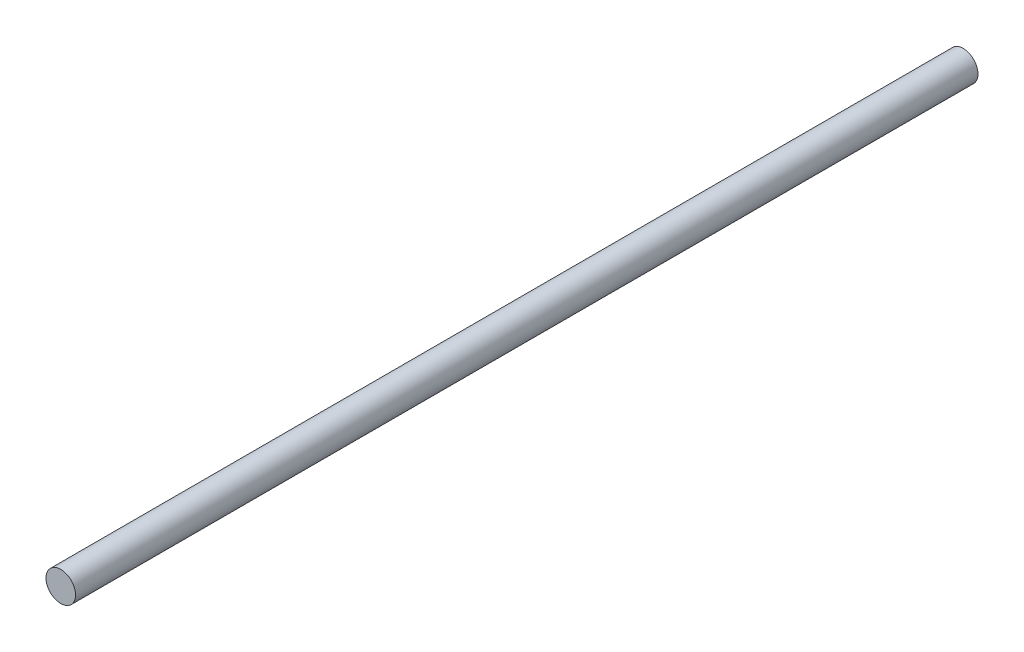
ISO-10303-21;
HEADER;
FILE_DESCRIPTION(('STEP AP214'),'2;1');
FILE_NAME('part.step','',(''),(''),'','','');
FILE_SCHEMA(('AUTOMOTIVE_DESIGN { 1 0 10303 214 1 1 1 1 }'));
ENDSEC;
DATA;
#1=APPLICATION_CONTEXT('core data for automotive mechanical design processes');
#2=APPLICATION_PROTOCOL_DEFINITION('international standard','automotive_design',2000,#1);
#3=PRODUCT_CONTEXT('',#1,'mechanical');
#4=PRODUCT('Part','Part','',(#3));
#5=PRODUCT_RELATED_PRODUCT_CATEGORY('part','',(#4));
#6=PRODUCT_DEFINITION_FORMATION('','',#4);
#7=PRODUCT_DEFINITION_CONTEXT('part definition',#1,'design');
#8=PRODUCT_DEFINITION('design','',#6,#7);
#9=PRODUCT_DEFINITION_SHAPE('','',#8);
#10=(LENGTH_UNIT() NAMED_UNIT(*) SI_UNIT(.MILLI.,.METRE.));
#11=(NAMED_UNIT(*) PLANE_ANGLE_UNIT() SI_UNIT($,.RADIAN.));
#12=(NAMED_UNIT(*) SI_UNIT($,.STERADIAN.) SOLID_ANGLE_UNIT());
#13=UNCERTAINTY_MEASURE_WITH_UNIT(LENGTH_MEASURE(1.E-05),#10,'distance_accuracy_value','');
#14=(GEOMETRIC_REPRESENTATION_CONTEXT(3) GLOBAL_UNCERTAINTY_ASSIGNED_CONTEXT((#13)) GLOBAL_UNIT_ASSIGNED_CONTEXT((#10,
#11,#12)) REPRESENTATION_CONTEXT('',''));
#15=CARTESIAN_POINT('',(0.,0.,0.));
#16=DIRECTION('',(0.,0.,1.));
#17=DIRECTION('',(1.,0.,0.));
#18=AXIS2_PLACEMENT_3D('',#15,#16,#17);
#19=CARTESIAN_POINT('',(0.,0.,305.));
#20=DIRECTION('',(0.,0.,-1.));
#21=DIRECTION('',(-1.,0.,0.));
#22=AXIS2_PLACEMENT_3D('',#19,#20,#21);
#23=CYLINDRICAL_SURFACE('',#22,5.);
#24=CARTESIAN_POINT('',(0.,0.,305.));
#25=DIRECTION('',(0.,0.,1.));
#26=DIRECTION('',(1.,0.,0.));
#27=AXIS2_PLACEMENT_3D('',#24,#25,#26);
#28=CIRCLE('',#27,5.);
#29=CARTESIAN_POINT('',(5.,0.,305.));
#30=VERTEX_POINT('',#29);
#31=EDGE_CURVE('E10',#30,#30,#28,.T.);
#32=ORIENTED_EDGE('',*,*,#31,.F.);
#33=EDGE_LOOP('',(#32));
#34=FACE_BOUND('',#33,.T.);
#35=CARTESIAN_POINT('',(0.,0.,0.));
#36=DIRECTION('',(0.,0.,1.));
#37=DIRECTION('',(1.,0.,0.));
#38=AXIS2_PLACEMENT_3D('',#35,#36,#37);
#39=CIRCLE('',#38,5.);
#40=CARTESIAN_POINT('',(5.,0.,0.));
#41=VERTEX_POINT('',#40);
#42=EDGE_CURVE('E33',#41,#41,#39,.T.);
#43=ORIENTED_EDGE('',*,*,#42,.T.);
#44=EDGE_LOOP('',(#43));
#45=FACE_BOUND('',#44,.T.);
#46=ADVANCED_FACE('F30',(#34,#45),#23,.T.);
#47=CARTESIAN_POINT('',(0.,0.,305.));
#48=DIRECTION('',(0.,0.,1.));
#49=DIRECTION('',(1.,0.,0.));
#50=AXIS2_PLACEMENT_3D('',#47,#48,#49);
#51=PLANE('',#50);
#52=ORIENTED_EDGE('',*,*,#31,.T.);
#53=EDGE_LOOP('',(#52));
#54=FACE_BOUND('',#53,.T.);
#55=ADVANCED_FACE('F45',(#54),#51,.T.);
#56=CARTESIAN_POINT('',(0.,0.,0.));
#57=DIRECTION('',(0.,0.,1.));
#58=DIRECTION('',(1.,0.,0.));
#59=AXIS2_PLACEMENT_3D('',#56,#57,#58);
#60=PLANE('',#59);
#61=ORIENTED_EDGE('',*,*,#42,.F.);
#62=EDGE_LOOP('',(#61));
#63=FACE_BOUND('',#62,.T.);
#64=ADVANCED_FACE('F43',(#63),#60,.F.);
#65=CLOSED_SHELL('',(#46,#55,#64));
#66=MANIFOLD_SOLID_BREP('B2',#65);
#67=ADVANCED_BREP_SHAPE_REPRESENTATION('',(#18,#66),#14);
#68=SHAPE_DEFINITION_REPRESENTATION(#9,#67);
ENDSEC;
END-ISO-10303-21;
